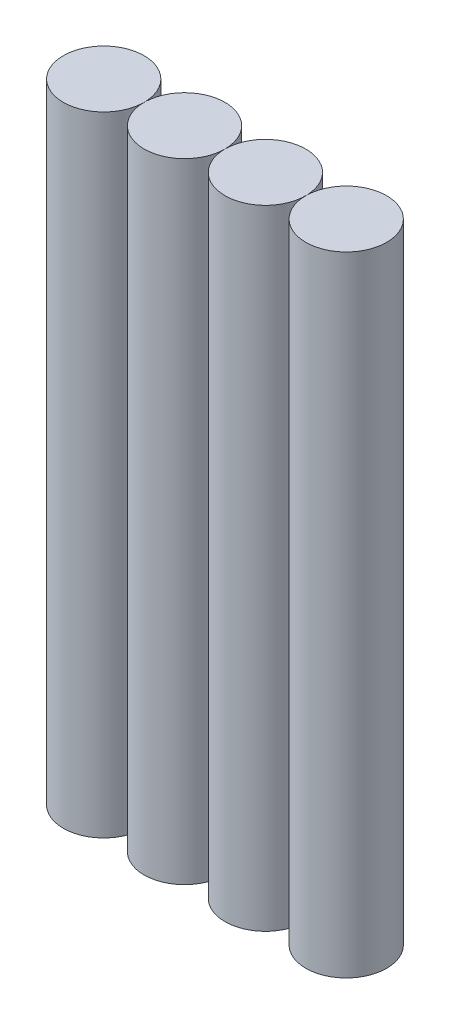
ISO-10303-21;
HEADER;
FILE_DESCRIPTION(('STEP AP214'),'2;1');
FILE_NAME('part.step','',(''),(''),'','','');
FILE_SCHEMA(('AUTOMOTIVE_DESIGN { 1 0 10303 214 1 1 1 1 }'));
ENDSEC;
DATA;
#1=APPLICATION_CONTEXT('core data for automotive mechanical design processes');
#2=APPLICATION_PROTOCOL_DEFINITION('international standard','automotive_design',2000,#1);
#3=PRODUCT_CONTEXT('',#1,'mechanical');
#4=PRODUCT('Part','Part','',(#3));
#5=PRODUCT_RELATED_PRODUCT_CATEGORY('part','',(#4));
#6=PRODUCT_DEFINITION_FORMATION('','',#4);
#7=PRODUCT_DEFINITION_CONTEXT('part definition',#1,'design');
#8=PRODUCT_DEFINITION('design','',#6,#7);
#9=PRODUCT_DEFINITION_SHAPE('','',#8);
#10=(LENGTH_UNIT() NAMED_UNIT(*) SI_UNIT(.MILLI.,.METRE.));
#11=(NAMED_UNIT(*) PLANE_ANGLE_UNIT() SI_UNIT($,.RADIAN.));
#12=(NAMED_UNIT(*) SI_UNIT($,.STERADIAN.) SOLID_ANGLE_UNIT());
#13=UNCERTAINTY_MEASURE_WITH_UNIT(LENGTH_MEASURE(1.E-05),#10,'distance_accuracy_value','');
#14=(GEOMETRIC_REPRESENTATION_CONTEXT(3) GLOBAL_UNCERTAINTY_ASSIGNED_CONTEXT((#13)) GLOBAL_UNIT_ASSIGNED_CONTEXT((#10,
#11,#12)) REPRESENTATION_CONTEXT('',''));
#15=CARTESIAN_POINT('',(0.,0.,0.));
#16=DIRECTION('',(0.,0.,1.));
#17=DIRECTION('',(1.,0.,0.));
#18=AXIS2_PLACEMENT_3D('',#15,#16,#17);
#19=CARTESIAN_POINT('',(54.,140.,0.));
#20=DIRECTION('',(0.,-1.,0.));
#21=DIRECTION('',(0.,0.,-1.));
#22=AXIS2_PLACEMENT_3D('',#19,#20,#21);
#23=CYLINDRICAL_SURFACE('',#22,9.);
#24=CARTESIAN_POINT('',(54.,140.,0.));
#25=DIRECTION('',(0.,1.,0.));
#26=DIRECTION('',(0.,0.,1.));
#27=AXIS2_PLACEMENT_3D('',#24,#25,#26);
#28=CIRCLE('',#27,9.);
#29=CARTESIAN_POINT('',(54.,140.,9.));
#30=VERTEX_POINT('',#29);
#31=EDGE_CURVE('E12',#30,#30,#28,.T.);
#32=ORIENTED_EDGE('',*,*,#31,.F.);
#33=EDGE_LOOP('',(#32));
#34=FACE_BOUND('',#33,.T.);
#35=CARTESIAN_POINT('',(54.,0.,0.));
#36=DIRECTION('',(0.,1.,0.));
#37=DIRECTION('',(0.,0.,1.));
#38=AXIS2_PLACEMENT_3D('',#35,#36,#37);
#39=CIRCLE('',#38,9.);
#40=CARTESIAN_POINT('',(54.,0.,9.));
#41=VERTEX_POINT('',#40);
#42=EDGE_CURVE('E61',#41,#41,#39,.T.);
#43=ORIENTED_EDGE('',*,*,#42,.T.);
#44=EDGE_LOOP('',(#43));
#45=FACE_BOUND('',#44,.T.);
#46=ADVANCED_FACE('F58',(#34,#45),#23,.T.);
#47=CARTESIAN_POINT('',(0.,140.,0.));
#48=DIRECTION('',(0.,1.,0.));
#49=DIRECTION('',(0.,0.,1.));
#50=AXIS2_PLACEMENT_3D('',#47,#48,#49);
#51=PLANE('',#50);
#52=ORIENTED_EDGE('',*,*,#31,.T.);
#53=EDGE_LOOP('',(#52));
#54=FACE_BOUND('',#53,.T.);
#55=ADVANCED_FACE('F73',(#54),#51,.T.);
#56=CARTESIAN_POINT('',(0.,0.,0.));
#57=DIRECTION('',(0.,1.,0.));
#58=DIRECTION('',(0.,0.,1.));
#59=AXIS2_PLACEMENT_3D('',#56,#57,#58);
#60=PLANE('',#59);
#61=ORIENTED_EDGE('',*,*,#42,.F.);
#62=EDGE_LOOP('',(#61));
#63=FACE_BOUND('',#62,.T.);
#64=ADVANCED_FACE('F71',(#63),#60,.F.);
#65=CLOSED_SHELL('',(#46,#55,#64));
#66=MANIFOLD_SOLID_BREP('B2',#65);
#67=CARTESIAN_POINT('',(36.,140.,0.));
#68=DIRECTION('',(0.,-1.,0.));
#69=DIRECTION('',(0.,0.,-1.));
#70=AXIS2_PLACEMENT_3D('',#67,#68,#69);
#71=CYLINDRICAL_SURFACE('',#70,9.);
#72=CARTESIAN_POINT('',(36.,140.,0.));
#73=DIRECTION('',(0.,1.,0.));
#74=DIRECTION('',(0.,0.,1.));
#75=AXIS2_PLACEMENT_3D('',#72,#73,#74);
#76=CIRCLE('',#75,9.);
#77=CARTESIAN_POINT('',(36.,140.,9.));
#78=VERTEX_POINT('',#77);
#79=EDGE_CURVE('E57',#78,#78,#76,.T.);
#80=ORIENTED_EDGE('',*,*,#79,.F.);
#81=EDGE_LOOP('',(#80));
#82=FACE_BOUND('',#81,.T.);
#83=CARTESIAN_POINT('',(36.,0.,0.));
#84=DIRECTION('',(0.,1.,0.));
#85=DIRECTION('',(0.,0.,1.));
#86=AXIS2_PLACEMENT_3D('',#83,#84,#85);
#87=CIRCLE('',#86,9.);
#88=CARTESIAN_POINT('',(36.,0.,9.));
#89=VERTEX_POINT('',#88);
#90=EDGE_CURVE('E110',#89,#89,#87,.T.);
#91=ORIENTED_EDGE('',*,*,#90,.T.);
#92=EDGE_LOOP('',(#91));
#93=FACE_BOUND('',#92,.T.);
#94=ADVANCED_FACE('F107',(#82,#93),#71,.T.);
#95=CARTESIAN_POINT('',(0.,140.,0.));
#96=DIRECTION('',(0.,1.,0.));
#97=DIRECTION('',(0.,0.,1.));
#98=AXIS2_PLACEMENT_3D('',#95,#96,#97);
#99=PLANE('',#98);
#100=ORIENTED_EDGE('',*,*,#79,.T.);
#101=EDGE_LOOP('',(#100));
#102=FACE_BOUND('',#101,.T.);
#103=ADVANCED_FACE('F122',(#102),#99,.T.);
#104=CARTESIAN_POINT('',(0.,0.,0.));
#105=DIRECTION('',(0.,1.,0.));
#106=DIRECTION('',(0.,0.,1.));
#107=AXIS2_PLACEMENT_3D('',#104,#105,#106);
#108=PLANE('',#107);
#109=ORIENTED_EDGE('',*,*,#90,.F.);
#110=EDGE_LOOP('',(#109));
#111=FACE_BOUND('',#110,.T.);
#112=ADVANCED_FACE('F120',(#111),#108,.F.);
#113=CLOSED_SHELL('',(#94,#103,#112));
#114=MANIFOLD_SOLID_BREP('B7',#113);
#115=CARTESIAN_POINT('',(0.,140.,0.));
#116=DIRECTION('',(0.,-1.,0.));
#117=DIRECTION('',(0.,0.,-1.));
#118=AXIS2_PLACEMENT_3D('',#115,#116,#117);
#119=CYLINDRICAL_SURFACE('',#118,9.);
#120=CARTESIAN_POINT('',(0.,140.,0.));
#121=DIRECTION('',(0.,1.,0.));
#122=DIRECTION('',(0.,0.,1.));
#123=AXIS2_PLACEMENT_3D('',#120,#121,#122);
#124=CIRCLE('',#123,9.);
#125=CARTESIAN_POINT('',(0.,140.,9.));
#126=VERTEX_POINT('',#125);
#127=EDGE_CURVE('E106',#126,#126,#124,.T.);
#128=ORIENTED_EDGE('',*,*,#127,.F.);
#129=EDGE_LOOP('',(#128));
#130=FACE_BOUND('',#129,.T.);
#131=CARTESIAN_POINT('',(0.,0.,0.));
#132=DIRECTION('',(0.,1.,0.));
#133=DIRECTION('',(0.,0.,1.));
#134=AXIS2_PLACEMENT_3D('',#131,#132,#133);
#135=CIRCLE('',#134,9.);
#136=CARTESIAN_POINT('',(0.,0.,9.));
#137=VERTEX_POINT('',#136);
#138=EDGE_CURVE('E164',#137,#137,#135,.T.);
#139=ORIENTED_EDGE('',*,*,#138,.T.);
#140=EDGE_LOOP('',(#139));
#141=FACE_BOUND('',#140,.T.);
#142=ADVANCED_FACE('F161',(#130,#141),#119,.T.);
#143=CARTESIAN_POINT('',(0.,140.,0.));
#144=DIRECTION('',(0.,1.,0.));
#145=DIRECTION('',(0.,0.,1.));
#146=AXIS2_PLACEMENT_3D('',#143,#144,#145);
#147=PLANE('',#146);
#148=ORIENTED_EDGE('',*,*,#127,.T.);
#149=EDGE_LOOP('',(#148));
#150=FACE_BOUND('',#149,.T.);
#151=ADVANCED_FACE('F176',(#150),#147,.T.);
#152=CARTESIAN_POINT('',(0.,0.,0.));
#153=DIRECTION('',(0.,1.,0.));
#154=DIRECTION('',(0.,0.,1.));
#155=AXIS2_PLACEMENT_3D('',#152,#153,#154);
#156=PLANE('',#155);
#157=ORIENTED_EDGE('',*,*,#138,.F.);
#158=EDGE_LOOP('',(#157));
#159=FACE_BOUND('',#158,.T.);
#160=ADVANCED_FACE('F174',(#159),#156,.F.);
#161=CLOSED_SHELL('',(#142,#151,#160));
#162=MANIFOLD_SOLID_BREP('B52',#161);
#163=CARTESIAN_POINT('',(18.,140.,0.));
#164=DIRECTION('',(0.,-1.,0.));
#165=DIRECTION('',(0.,0.,-1.));
#166=AXIS2_PLACEMENT_3D('',#163,#164,#165);
#167=CYLINDRICAL_SURFACE('',#166,9.00000000000001);
#168=CARTESIAN_POINT('',(18.,140.,0.));
#169=DIRECTION('',(0.,1.,0.));
#170=DIRECTION('',(0.,0.,1.));
#171=AXIS2_PLACEMENT_3D('',#168,#169,#170);
#172=CIRCLE('',#171,9.00000000000001);
#173=CARTESIAN_POINT('',(18.,140.,9.00000000000001));
#174=VERTEX_POINT('',#173);
#175=EDGE_CURVE('E160',#174,#174,#172,.T.);
#176=ORIENTED_EDGE('',*,*,#175,.F.);
#177=EDGE_LOOP('',(#176));
#178=FACE_BOUND('',#177,.T.);
#179=CARTESIAN_POINT('',(18.,0.,0.));
#180=DIRECTION('',(0.,1.,0.));
#181=DIRECTION('',(0.,0.,1.));
#182=AXIS2_PLACEMENT_3D('',#179,#180,#181);
#183=CIRCLE('',#182,9.00000000000001);
#184=CARTESIAN_POINT('',(18.,0.,9.00000000000001));
#185=VERTEX_POINT('',#184);
#186=EDGE_CURVE('E205',#185,#185,#183,.T.);
#187=ORIENTED_EDGE('',*,*,#186,.T.);
#188=EDGE_LOOP('',(#187));
#189=FACE_BOUND('',#188,.T.);
#190=ADVANCED_FACE('F202',(#178,#189),#167,.T.);
#191=CARTESIAN_POINT('',(0.,140.,0.));
#192=DIRECTION('',(0.,1.,0.));
#193=DIRECTION('',(0.,0.,1.));
#194=AXIS2_PLACEMENT_3D('',#191,#192,#193);
#195=PLANE('',#194);
#196=ORIENTED_EDGE('',*,*,#175,.T.);
#197=EDGE_LOOP('',(#196));
#198=FACE_BOUND('',#197,.T.);
#199=ADVANCED_FACE('F217',(#198),#195,.T.);
#200=CARTESIAN_POINT('',(0.,0.,0.));
#201=DIRECTION('',(0.,1.,0.));
#202=DIRECTION('',(0.,0.,1.));
#203=AXIS2_PLACEMENT_3D('',#200,#201,#202);
#204=PLANE('',#203);
#205=ORIENTED_EDGE('',*,*,#186,.F.);
#206=EDGE_LOOP('',(#205));
#207=FACE_BOUND('',#206,.T.);
#208=ADVANCED_FACE('F215',(#207),#204,.F.);
#209=CLOSED_SHELL('',(#190,#199,#208));
#210=MANIFOLD_SOLID_BREP('B101',#209);
#211=ADVANCED_BREP_SHAPE_REPRESENTATION('',(#18,#66,#114,#162,#210),#14);
#212=SHAPE_DEFINITION_REPRESENTATION(#9,#211);
ENDSEC;
END-ISO-10303-21;
